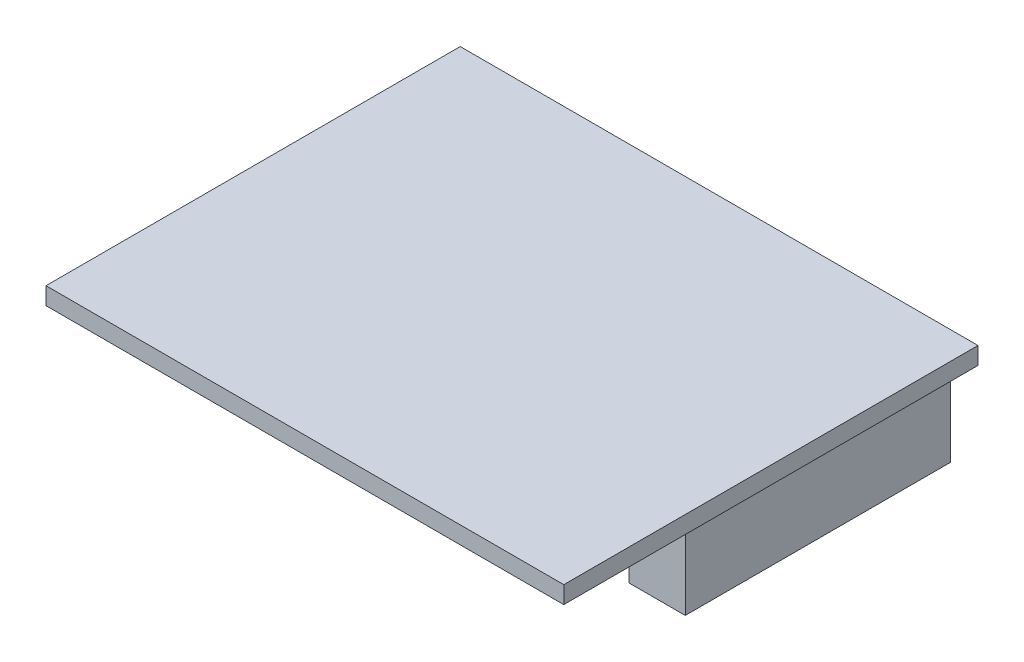
ISO-10303-21;
HEADER;
FILE_DESCRIPTION(('STEP AP214'),'2;1');
FILE_NAME('part.step','',(''),(''),'','','');
FILE_SCHEMA(('AUTOMOTIVE_DESIGN { 1 0 10303 214 1 1 1 1 }'));
ENDSEC;
DATA;
#1=APPLICATION_CONTEXT('core data for automotive mechanical design processes');
#2=APPLICATION_PROTOCOL_DEFINITION('international standard','automotive_design',2000,#1);
#3=PRODUCT_CONTEXT('',#1,'mechanical');
#4=PRODUCT('Part','Part','',(#3));
#5=PRODUCT_RELATED_PRODUCT_CATEGORY('part','',(#4));
#6=PRODUCT_DEFINITION_FORMATION('','',#4);
#7=PRODUCT_DEFINITION_CONTEXT('part definition',#1,'design');
#8=PRODUCT_DEFINITION('design','',#6,#7);
#9=PRODUCT_DEFINITION_SHAPE('','',#8);
#10=(LENGTH_UNIT() NAMED_UNIT(*) SI_UNIT(.MILLI.,.METRE.));
#11=(NAMED_UNIT(*) PLANE_ANGLE_UNIT() SI_UNIT($,.RADIAN.));
#12=(NAMED_UNIT(*) SI_UNIT($,.STERADIAN.) SOLID_ANGLE_UNIT());
#13=UNCERTAINTY_MEASURE_WITH_UNIT(LENGTH_MEASURE(1.E-05),#10,'distance_accuracy_value','');
#14=(GEOMETRIC_REPRESENTATION_CONTEXT(3) GLOBAL_UNCERTAINTY_ASSIGNED_CONTEXT((#13)) GLOBAL_UNIT_ASSIGNED_CONTEXT((#10,
#11,#12)) REPRESENTATION_CONTEXT('',''));
#15=CARTESIAN_POINT('',(0.,0.,0.));
#16=DIRECTION('',(0.,0.,1.));
#17=DIRECTION('',(1.,0.,0.));
#18=AXIS2_PLACEMENT_3D('',#15,#16,#17);
#19=CARTESIAN_POINT('',(-25.4,1.7,20.32));
#20=DIRECTION('',(0.,-1.,0.));
#21=DIRECTION('',(0.,0.,-1.));
#22=AXIS2_PLACEMENT_3D('',#19,#20,#21);
#23=PLANE('',#22);
#24=DIRECTION('',(-1.,0.,0.));
#25=VECTOR('',#24,1.);
#26=CARTESIAN_POINT('',(0.,1.7,-20.32));
#27=LINE('',#26,#25);
#28=CARTESIAN_POINT('',(25.4,1.7,-20.32));
#29=VERTEX_POINT('',#28);
#30=CARTESIAN_POINT('',(-25.4,1.7,-20.32));
#31=VERTEX_POINT('',#30);
#32=EDGE_CURVE('E130',#29,#31,#27,.T.);
#33=ORIENTED_EDGE('',*,*,#32,.T.);
#34=DIRECTION('',(0.,0.,1.));
#35=VECTOR('',#34,1.);
#36=CARTESIAN_POINT('',(-25.4,1.7,0.));
#37=LINE('',#36,#35);
#38=CARTESIAN_POINT('',(-25.4,1.7,20.32));
#39=VERTEX_POINT('',#38);
#40=EDGE_CURVE('E105',#31,#39,#37,.T.);
#41=ORIENTED_EDGE('',*,*,#40,.T.);
#42=DIRECTION('',(1.,0.,0.));
#43=VECTOR('',#42,1.);
#44=CARTESIAN_POINT('',(0.,1.7,20.32));
#45=LINE('',#44,#43);
#46=CARTESIAN_POINT('',(25.4,1.7,20.32));
#47=VERTEX_POINT('',#46);
#48=EDGE_CURVE('E107',#39,#47,#45,.T.);
#49=ORIENTED_EDGE('',*,*,#48,.T.);
#50=DIRECTION('',(0.,0.,-1.));
#51=VECTOR('',#50,1.);
#52=CARTESIAN_POINT('',(25.4,1.7,0.));
#53=LINE('',#52,#51);
#54=EDGE_CURVE('E21',#47,#29,#53,.T.);
#55=ORIENTED_EDGE('',*,*,#54,.T.);
#56=EDGE_LOOP('',(#33,#41,#49,#55));
#57=FACE_BOUND('',#56,.T.);
#58=ADVANCED_FACE('F17',(#57),#23,.F.);
#59=CARTESIAN_POINT('',(-24.4,-8.6,-19.32));
#60=DIRECTION('',(0.,1.,0.));
#61=DIRECTION('',(0.,0.,1.));
#62=AXIS2_PLACEMENT_3D('',#59,#60,#61);
#63=PLANE('',#62);
#64=DIRECTION('',(-1.,0.,0.));
#65=VECTOR('',#64,1.);
#66=CARTESIAN_POINT('',(-21.9,-8.6,6.68));
#67=LINE('',#66,#65);
#68=CARTESIAN_POINT('',(-19.4,-8.6,6.68));
#69=VERTEX_POINT('',#68);
#70=CARTESIAN_POINT('',(-24.4,-8.6,6.68));
#71=VERTEX_POINT('',#70);
#72=EDGE_CURVE('E134',#69,#71,#67,.T.);
#73=ORIENTED_EDGE('',*,*,#72,.T.);
#74=DIRECTION('',(0.,0.,-1.));
#75=VECTOR('',#74,1.);
#76=CARTESIAN_POINT('',(-24.4,-8.6,-6.32));
#77=LINE('',#76,#75);
#78=CARTESIAN_POINT('',(-24.4,-8.6,-19.32));
#79=VERTEX_POINT('',#78);
#80=EDGE_CURVE('E147',#71,#79,#77,.T.);
#81=ORIENTED_EDGE('',*,*,#80,.T.);
#82=DIRECTION('',(1.,0.,0.));
#83=VECTOR('',#82,1.);
#84=CARTESIAN_POINT('',(-21.9,-8.6,-19.32));
#85=LINE('',#84,#83);
#86=CARTESIAN_POINT('',(-19.4,-8.6,-19.32));
#87=VERTEX_POINT('',#86);
#88=EDGE_CURVE('E140',#79,#87,#85,.T.);
#89=ORIENTED_EDGE('',*,*,#88,.T.);
#90=DIRECTION('',(0.,0.,1.));
#91=VECTOR('',#90,1.);
#92=CARTESIAN_POINT('',(-19.4,-8.6,-6.32));
#93=LINE('',#92,#91);
#94=EDGE_CURVE('E136',#87,#69,#93,.T.);
#95=ORIENTED_EDGE('',*,*,#94,.T.);
#96=EDGE_LOOP('',(#73,#81,#89,#95));
#97=FACE_BOUND('',#96,.T.);
#98=ADVANCED_FACE('F255',(#97),#63,.F.);
#99=CARTESIAN_POINT('',(18.18,-8.6,-19.32));
#100=DIRECTION('',(0.,1.,0.));
#101=DIRECTION('',(0.,0.,1.));
#102=AXIS2_PLACEMENT_3D('',#99,#100,#101);
#103=PLANE('',#102);
#104=DIRECTION('',(0.,0.,-1.));
#105=VECTOR('',#104,1.);
#106=CARTESIAN_POINT('',(18.18,-8.6,-6.32));
#107=LINE('',#106,#105);
#108=CARTESIAN_POINT('',(18.18,-8.6,6.68));
#109=VERTEX_POINT('',#108);
#110=CARTESIAN_POINT('',(18.18,-8.6,-19.32));
#111=VERTEX_POINT('',#110);
#112=EDGE_CURVE('E157',#109,#111,#107,.T.);
#113=ORIENTED_EDGE('',*,*,#112,.T.);
#114=DIRECTION('',(1.,0.,0.));
#115=VECTOR('',#114,1.);
#116=CARTESIAN_POINT('',(20.93,-8.6,-19.32));
#117=LINE('',#116,#115);
#118=CARTESIAN_POINT('',(23.68,-8.6,-19.32));
#119=VERTEX_POINT('',#118);
#120=EDGE_CURVE('E153',#111,#119,#117,.T.);
#121=ORIENTED_EDGE('',*,*,#120,.T.);
#122=DIRECTION('',(0.,0.,1.));
#123=VECTOR('',#122,1.);
#124=CARTESIAN_POINT('',(23.68,-8.6,-6.32));
#125=LINE('',#124,#123);
#126=CARTESIAN_POINT('',(23.68,-8.6,6.68));
#127=VERTEX_POINT('',#126);
#128=EDGE_CURVE('E151',#119,#127,#125,.T.);
#129=ORIENTED_EDGE('',*,*,#128,.T.);
#130=DIRECTION('',(-1.,0.,0.));
#131=VECTOR('',#130,1.);
#132=CARTESIAN_POINT('',(20.93,-8.6,6.68));
#133=LINE('',#132,#131);
#134=EDGE_CURVE('E164',#127,#109,#133,.T.);
#135=ORIENTED_EDGE('',*,*,#134,.T.);
#136=EDGE_LOOP('',(#113,#121,#129,#135));
#137=FACE_BOUND('',#136,.T.);
#138=ADVANCED_FACE('F206',(#137),#103,.F.);
#139=CARTESIAN_POINT('',(25.4,0.,-20.32));
#140=DIRECTION('',(-1.,0.,0.));
#141=DIRECTION('',(0.,0.,1.));
#142=AXIS2_PLACEMENT_3D('',#139,#140,#141);
#143=PLANE('',#142);
#144=DIRECTION('',(0.,1.,0.));
#145=VECTOR('',#144,1.);
#146=CARTESIAN_POINT('',(25.4,0.85,-20.32));
#147=LINE('',#146,#145);
#148=CARTESIAN_POINT('',(25.4,0.,-20.32));
#149=VERTEX_POINT('',#148);
#150=EDGE_CURVE('E118',#149,#29,#147,.T.);
#151=ORIENTED_EDGE('',*,*,#150,.T.);
#152=ORIENTED_EDGE('',*,*,#54,.F.);
#153=DIRECTION('',(0.,-1.,0.));
#154=VECTOR('',#153,1.);
#155=CARTESIAN_POINT('',(25.4,0.85,20.32));
#156=LINE('',#155,#154);
#157=CARTESIAN_POINT('',(25.4,0.,20.32));
#158=VERTEX_POINT('',#157);
#159=EDGE_CURVE('E113',#47,#158,#156,.T.);
#160=ORIENTED_EDGE('',*,*,#159,.T.);
#161=DIRECTION('',(0.,0.,1.));
#162=VECTOR('',#161,1.);
#163=CARTESIAN_POINT('',(25.4,0.,0.));
#164=LINE('',#163,#162);
#165=EDGE_CURVE('E167',#149,#158,#164,.T.);
#166=ORIENTED_EDGE('',*,*,#165,.F.);
#167=EDGE_LOOP('',(#151,#152,#160,#166));
#168=FACE_BOUND('',#167,.T.);
#169=ADVANCED_FACE('F115',(#168),#143,.F.);
#170=CARTESIAN_POINT('',(25.4,0.,20.32));
#171=DIRECTION('',(0.,0.,-1.));
#172=DIRECTION('',(-1.,0.,0.));
#173=AXIS2_PLACEMENT_3D('',#170,#171,#172);
#174=PLANE('',#173);
#175=ORIENTED_EDGE('',*,*,#159,.F.);
#176=ORIENTED_EDGE('',*,*,#48,.F.);
#177=DIRECTION('',(0.,-1.,0.));
#178=VECTOR('',#177,1.);
#179=CARTESIAN_POINT('',(-25.4,0.85,20.32));
#180=LINE('',#179,#178);
#181=CARTESIAN_POINT('',(-25.4,0.,20.32));
#182=VERTEX_POINT('',#181);
#183=EDGE_CURVE('E125',#39,#182,#180,.T.);
#184=ORIENTED_EDGE('',*,*,#183,.T.);
#185=DIRECTION('',(-1.,0.,0.));
#186=VECTOR('',#185,1.);
#187=CARTESIAN_POINT('',(0.,0.,20.32));
#188=LINE('',#187,#186);
#189=EDGE_CURVE('E122',#158,#182,#188,.T.);
#190=ORIENTED_EDGE('',*,*,#189,.F.);
#191=EDGE_LOOP('',(#175,#176,#184,#190));
#192=FACE_BOUND('',#191,.T.);
#193=ADVANCED_FACE('F120',(#192),#174,.F.);
#194=CARTESIAN_POINT('',(-25.4,0.,20.32));
#195=DIRECTION('',(1.,0.,0.));
#196=DIRECTION('',(0.,0.,-1.));
#197=AXIS2_PLACEMENT_3D('',#194,#195,#196);
#198=PLANE('',#197);
#199=ORIENTED_EDGE('',*,*,#183,.F.);
#200=ORIENTED_EDGE('',*,*,#40,.F.);
#201=DIRECTION('',(0.,-1.,0.));
#202=VECTOR('',#201,1.);
#203=CARTESIAN_POINT('',(-25.4,0.85,-20.32));
#204=LINE('',#203,#202);
#205=CARTESIAN_POINT('',(-25.4,0.,-20.32));
#206=VERTEX_POINT('',#205);
#207=EDGE_CURVE('E132',#31,#206,#204,.T.);
#208=ORIENTED_EDGE('',*,*,#207,.T.);
#209=DIRECTION('',(0.,0.,-1.));
#210=VECTOR('',#209,1.);
#211=CARTESIAN_POINT('',(-25.4,0.,0.));
#212=LINE('',#211,#210);
#213=EDGE_CURVE('E170',#182,#206,#212,.T.);
#214=ORIENTED_EDGE('',*,*,#213,.F.);
#215=EDGE_LOOP('',(#199,#200,#208,#214));
#216=FACE_BOUND('',#215,.T.);
#217=ADVANCED_FACE('F244',(#216),#198,.F.);
#218=CARTESIAN_POINT('',(-25.4,0.,-20.32));
#219=DIRECTION('',(0.,0.,1.));
#220=DIRECTION('',(1.,0.,0.));
#221=AXIS2_PLACEMENT_3D('',#218,#219,#220);
#222=PLANE('',#221);
#223=ORIENTED_EDGE('',*,*,#207,.F.);
#224=ORIENTED_EDGE('',*,*,#32,.F.);
#225=ORIENTED_EDGE('',*,*,#150,.F.);
#226=DIRECTION('',(1.,0.,0.));
#227=VECTOR('',#226,1.);
#228=CARTESIAN_POINT('',(0.,0.,-20.32));
#229=LINE('',#228,#227);
#230=EDGE_CURVE('E173',#206,#149,#229,.T.);
#231=ORIENTED_EDGE('',*,*,#230,.F.);
#232=EDGE_LOOP('',(#223,#224,#225,#231));
#233=FACE_BOUND('',#232,.T.);
#234=ADVANCED_FACE('F240',(#233),#222,.F.);
#235=CARTESIAN_POINT('',(-19.4,-8.6,6.68));
#236=DIRECTION('',(0.,0.,-1.));
#237=DIRECTION('',(-1.,0.,0.));
#238=AXIS2_PLACEMENT_3D('',#235,#236,#237);
#239=PLANE('',#238);
#240=DIRECTION('',(0.,-1.,0.));
#241=VECTOR('',#240,1.);
#242=CARTESIAN_POINT('',(-24.4,-4.3,6.68));
#243=LINE('',#242,#241);
#244=CARTESIAN_POINT('',(-24.4000000047,0.,6.68000000264));
#245=VERTEX_POINT('',#244);
#246=EDGE_CURVE('E144',#245,#71,#243,.T.);
#247=ORIENTED_EDGE('',*,*,#246,.T.);
#248=ORIENTED_EDGE('',*,*,#72,.F.);
#249=DIRECTION('',(0.,1.,0.));
#250=VECTOR('',#249,1.);
#251=CARTESIAN_POINT('',(-19.4,-4.3,6.68));
#252=LINE('',#251,#250);
#253=CARTESIAN_POINT('',(-19.4000000028,0.,6.68000000264));
#254=VERTEX_POINT('',#253);
#255=EDGE_CURVE('E138',#69,#254,#252,.T.);
#256=ORIENTED_EDGE('',*,*,#255,.T.);
#257=DIRECTION('',(1.,0.,0.));
#258=VECTOR('',#257,1.);
#259=CARTESIAN_POINT('',(0.,0.,6.68000001056));
#260=LINE('',#259,#258);
#261=EDGE_CURVE('E176',#245,#254,#260,.T.);
#262=ORIENTED_EDGE('',*,*,#261,.F.);
#263=EDGE_LOOP('',(#247,#248,#256,#262));
#264=FACE_BOUND('',#263,.T.);
#265=ADVANCED_FACE('F236',(#264),#239,.F.);
#266=CARTESIAN_POINT('',(-19.4,-8.6,-19.32));
#267=DIRECTION('',(-1.,0.,0.));
#268=DIRECTION('',(0.,0.,1.));
#269=AXIS2_PLACEMENT_3D('',#266,#267,#268);
#270=PLANE('',#269);
#271=ORIENTED_EDGE('',*,*,#255,.F.);
#272=ORIENTED_EDGE('',*,*,#94,.F.);
#273=DIRECTION('',(0.,1.,0.));
#274=VECTOR('',#273,1.);
#275=CARTESIAN_POINT('',(-19.4,-4.3,-19.32));
#276=LINE('',#275,#274);
#277=CARTESIAN_POINT('',(-19.4000000028,0.,-19.32000000216));
#278=VERTEX_POINT('',#277);
#279=EDGE_CURVE('E142',#87,#278,#276,.T.);
#280=ORIENTED_EDGE('',*,*,#279,.T.);
#281=DIRECTION('',(0.,0.,-1.));
#282=VECTOR('',#281,1.);
#283=CARTESIAN_POINT('',(-19.4000000112,0.,0.));
#284=LINE('',#283,#282);
#285=EDGE_CURVE('E179',#254,#278,#284,.T.);
#286=ORIENTED_EDGE('',*,*,#285,.F.);
#287=EDGE_LOOP('',(#271,#272,#280,#286));
#288=FACE_BOUND('',#287,.T.);
#289=ADVANCED_FACE('F232',(#288),#270,.F.);
#290=CARTESIAN_POINT('',(-24.4,-8.6,-19.32));
#291=DIRECTION('',(0.,0.,1.));
#292=DIRECTION('',(1.,0.,0.));
#293=AXIS2_PLACEMENT_3D('',#290,#291,#292);
#294=PLANE('',#293);
#295=ORIENTED_EDGE('',*,*,#279,.F.);
#296=ORIENTED_EDGE('',*,*,#88,.F.);
#297=DIRECTION('',(0.,1.,0.));
#298=VECTOR('',#297,1.);
#299=CARTESIAN_POINT('',(-24.4,-4.3,-19.32));
#300=LINE('',#299,#298);
#301=CARTESIAN_POINT('',(-24.4000000047,0.,-19.32000000216));
#302=VERTEX_POINT('',#301);
#303=EDGE_CURVE('E149',#79,#302,#300,.T.);
#304=ORIENTED_EDGE('',*,*,#303,.T.);
#305=DIRECTION('',(-1.,0.,0.));
#306=VECTOR('',#305,1.);
#307=CARTESIAN_POINT('',(0.,0.,-19.32000000864));
#308=LINE('',#307,#306);
#309=EDGE_CURVE('E182',#278,#302,#308,.T.);
#310=ORIENTED_EDGE('',*,*,#309,.F.);
#311=EDGE_LOOP('',(#295,#296,#304,#310));
#312=FACE_BOUND('',#311,.T.);
#313=ADVANCED_FACE('F228',(#312),#294,.F.);
#314=CARTESIAN_POINT('',(-24.4,-8.6,6.68));
#315=DIRECTION('',(1.,0.,0.));
#316=DIRECTION('',(0.,0.,-1.));
#317=AXIS2_PLACEMENT_3D('',#314,#315,#316);
#318=PLANE('',#317);
#319=ORIENTED_EDGE('',*,*,#303,.F.);
#320=ORIENTED_EDGE('',*,*,#80,.F.);
#321=ORIENTED_EDGE('',*,*,#246,.F.);
#322=DIRECTION('',(0.,0.,1.));
#323=VECTOR('',#322,1.);
#324=CARTESIAN_POINT('',(-24.4000000188,0.,0.));
#325=LINE('',#324,#323);
#326=EDGE_CURVE('E185',#302,#245,#325,.T.);
#327=ORIENTED_EDGE('',*,*,#326,.F.);
#328=EDGE_LOOP('',(#319,#320,#321,#327));
#329=FACE_BOUND('',#328,.T.);
#330=ADVANCED_FACE('F225',(#329),#318,.F.);
#331=CARTESIAN_POINT('',(23.68,-8.6,-19.32));
#332=DIRECTION('',(-1.,0.,0.));
#333=DIRECTION('',(0.,0.,1.));
#334=AXIS2_PLACEMENT_3D('',#331,#332,#333);
#335=PLANE('',#334);
#336=ORIENTED_EDGE('',*,*,#128,.F.);
#337=DIRECTION('',(0.,1.,0.));
#338=VECTOR('',#337,1.);
#339=CARTESIAN_POINT('',(23.68,-4.3,-19.32));
#340=LINE('',#339,#338);
#341=CARTESIAN_POINT('',(23.6799999964,0.,-19.32000000216));
#342=VERTEX_POINT('',#341);
#343=EDGE_CURVE('E155',#119,#342,#340,.T.);
#344=ORIENTED_EDGE('',*,*,#343,.T.);
#345=DIRECTION('',(0.,0.,-1.));
#346=VECTOR('',#345,1.);
#347=CARTESIAN_POINT('',(23.6799999856,0.,0.));
#348=LINE('',#347,#346);
#349=CARTESIAN_POINT('',(23.6799999964,0.,6.68000000264));
#350=VERTEX_POINT('',#349);
#351=EDGE_CURVE('E188',#350,#342,#348,.T.);
#352=ORIENTED_EDGE('',*,*,#351,.F.);
#353=DIRECTION('',(0.,-1.,0.));
#354=VECTOR('',#353,1.);
#355=CARTESIAN_POINT('',(23.68,-4.3,6.68));
#356=LINE('',#355,#354);
#357=EDGE_CURVE('E161',#350,#127,#356,.T.);
#358=ORIENTED_EDGE('',*,*,#357,.T.);
#359=EDGE_LOOP('',(#336,#344,#352,#358));
#360=FACE_BOUND('',#359,.T.);
#361=ADVANCED_FACE('F208',(#360),#335,.F.);
#362=CARTESIAN_POINT('',(18.18,-8.6,-19.32));
#363=DIRECTION('',(0.,0.,1.));
#364=DIRECTION('',(1.,0.,0.));
#365=AXIS2_PLACEMENT_3D('',#362,#363,#364);
#366=PLANE('',#365);
#367=ORIENTED_EDGE('',*,*,#120,.F.);
#368=DIRECTION('',(0.,1.,0.));
#369=VECTOR('',#368,1.);
#370=CARTESIAN_POINT('',(18.18,-4.3,-19.32));
#371=LINE('',#370,#369);
#372=CARTESIAN_POINT('',(18.1800000032,0.,-19.32000000216));
#373=VERTEX_POINT('',#372);
#374=EDGE_CURVE('E159',#111,#373,#371,.T.);
#375=ORIENTED_EDGE('',*,*,#374,.T.);
#376=DIRECTION('',(-1.,0.,0.));
#377=VECTOR('',#376,1.);
#378=CARTESIAN_POINT('',(0.,0.,-19.32000000864));
#379=LINE('',#378,#377);
#380=EDGE_CURVE('E191',#342,#373,#379,.T.);
#381=ORIENTED_EDGE('',*,*,#380,.F.);
#382=ORIENTED_EDGE('',*,*,#343,.F.);
#383=EDGE_LOOP('',(#367,#375,#381,#382));
#384=FACE_BOUND('',#383,.T.);
#385=ADVANCED_FACE('F202',(#384),#366,.F.);
#386=CARTESIAN_POINT('',(18.18,-8.6,6.68));
#387=DIRECTION('',(1.,0.,0.));
#388=DIRECTION('',(0.,0.,-1.));
#389=AXIS2_PLACEMENT_3D('',#386,#387,#388);
#390=PLANE('',#389);
#391=ORIENTED_EDGE('',*,*,#112,.F.);
#392=DIRECTION('',(0.,1.,0.));
#393=VECTOR('',#392,1.);
#394=CARTESIAN_POINT('',(18.18,-4.3,6.68));
#395=LINE('',#394,#393);
#396=CARTESIAN_POINT('',(18.1800000032,0.,6.68000000264));
#397=VERTEX_POINT('',#396);
#398=EDGE_CURVE('E36',#109,#397,#395,.T.);
#399=ORIENTED_EDGE('',*,*,#398,.T.);
#400=DIRECTION('',(0.,0.,1.));
#401=VECTOR('',#400,1.);
#402=CARTESIAN_POINT('',(18.1800000128,0.,0.));
#403=LINE('',#402,#401);
#404=EDGE_CURVE('E27',#373,#397,#403,.T.);
#405=ORIENTED_EDGE('',*,*,#404,.F.);
#406=ORIENTED_EDGE('',*,*,#374,.F.);
#407=EDGE_LOOP('',(#391,#399,#405,#406));
#408=FACE_BOUND('',#407,.T.);
#409=ADVANCED_FACE('F199',(#408),#390,.F.);
#410=CARTESIAN_POINT('',(23.68,-8.6,6.68));
#411=DIRECTION('',(0.,0.,-1.));
#412=DIRECTION('',(-1.,0.,0.));
#413=AXIS2_PLACEMENT_3D('',#410,#411,#412);
#414=PLANE('',#413);
#415=ORIENTED_EDGE('',*,*,#134,.F.);
#416=ORIENTED_EDGE('',*,*,#357,.F.);
#417=DIRECTION('',(1.,0.,0.));
#418=VECTOR('',#417,1.);
#419=CARTESIAN_POINT('',(0.,0.,6.68000001056));
#420=LINE('',#419,#418);
#421=EDGE_CURVE('E11',#397,#350,#420,.T.);
#422=ORIENTED_EDGE('',*,*,#421,.F.);
#423=ORIENTED_EDGE('',*,*,#398,.F.);
#424=EDGE_LOOP('',(#415,#416,#422,#423));
#425=FACE_BOUND('',#424,.T.);
#426=ADVANCED_FACE('F212',(#425),#414,.F.);
#427=CARTESIAN_POINT('',(-25.4,0.,20.32));
#428=DIRECTION('',(0.,-1.,0.));
#429=DIRECTION('',(0.,0.,-1.));
#430=AXIS2_PLACEMENT_3D('',#427,#428,#429);
#431=PLANE('',#430);
#432=ORIENTED_EDGE('',*,*,#404,.T.);
#433=ORIENTED_EDGE('',*,*,#421,.T.);
#434=ORIENTED_EDGE('',*,*,#351,.T.);
#435=ORIENTED_EDGE('',*,*,#380,.T.);
#436=EDGE_LOOP('',(#432,#433,#434,#435));
#437=FACE_BOUND('',#436,.T.);
#438=ORIENTED_EDGE('',*,*,#309,.T.);
#439=ORIENTED_EDGE('',*,*,#326,.T.);
#440=ORIENTED_EDGE('',*,*,#261,.T.);
#441=ORIENTED_EDGE('',*,*,#285,.T.);
#442=EDGE_LOOP('',(#438,#439,#440,#441));
#443=FACE_BOUND('',#442,.T.);
#444=ORIENTED_EDGE('',*,*,#213,.T.);
#445=ORIENTED_EDGE('',*,*,#230,.T.);
#446=ORIENTED_EDGE('',*,*,#165,.T.);
#447=ORIENTED_EDGE('',*,*,#189,.T.);
#448=EDGE_LOOP('',(#444,#445,#446,#447));
#449=FACE_BOUND('',#448,.T.);
#450=ADVANCED_FACE('F19',(#437,#443,#449),#431,.T.);
#451=CLOSED_SHELL('',(#58,#98,#138,#169,#193,#217,#234,#265,#289,#313,#330,#361,#385,#409,#426,#450));
#452=MANIFOLD_SOLID_BREP('B1',#451);
#453=ADVANCED_BREP_SHAPE_REPRESENTATION('',(#18,#452),#14);
#454=SHAPE_DEFINITION_REPRESENTATION(#9,#453);
ENDSEC;
END-ISO-10303-21;
